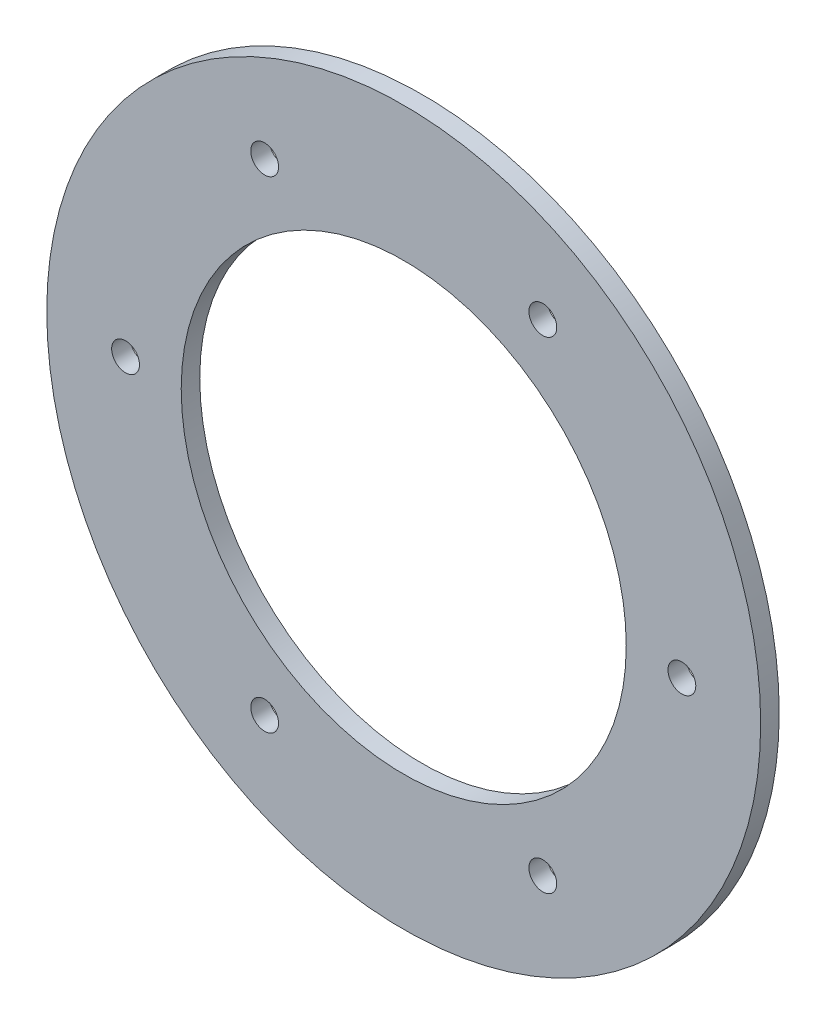
ISO-10303-21;
HEADER;
FILE_DESCRIPTION(('STEP AP214'),'2;1');
FILE_NAME('part.step','',(''),(''),'','','');
FILE_SCHEMA(('AUTOMOTIVE_DESIGN { 1 0 10303 214 1 1 1 1 }'));
ENDSEC;
DATA;
#1=APPLICATION_CONTEXT('core data for automotive mechanical design processes');
#2=APPLICATION_PROTOCOL_DEFINITION('international standard','automotive_design',2000,#1);
#3=PRODUCT_CONTEXT('',#1,'mechanical');
#4=PRODUCT('Part','Part','',(#3));
#5=PRODUCT_RELATED_PRODUCT_CATEGORY('part','',(#4));
#6=PRODUCT_DEFINITION_FORMATION('','',#4);
#7=PRODUCT_DEFINITION_CONTEXT('part definition',#1,'design');
#8=PRODUCT_DEFINITION('design','',#6,#7);
#9=PRODUCT_DEFINITION_SHAPE('','',#8);
#10=(LENGTH_UNIT() NAMED_UNIT(*) SI_UNIT(.MILLI.,.METRE.));
#11=(NAMED_UNIT(*) PLANE_ANGLE_UNIT() SI_UNIT($,.RADIAN.));
#12=(NAMED_UNIT(*) SI_UNIT($,.STERADIAN.) SOLID_ANGLE_UNIT());
#13=UNCERTAINTY_MEASURE_WITH_UNIT(LENGTH_MEASURE(1.E-05),#10,'distance_accuracy_value','');
#14=(GEOMETRIC_REPRESENTATION_CONTEXT(3) GLOBAL_UNCERTAINTY_ASSIGNED_CONTEXT((#13)) GLOBAL_UNIT_ASSIGNED_CONTEXT((#10,
#11,#12)) REPRESENTATION_CONTEXT('',''));
#15=CARTESIAN_POINT('',(0.,0.,0.));
#16=DIRECTION('',(0.,0.,1.));
#17=DIRECTION('',(1.,0.,0.));
#18=AXIS2_PLACEMENT_3D('',#15,#16,#17);
#19=CARTESIAN_POINT('',(0.,0.,2.));
#20=DIRECTION('',(0.,0.,1.));
#21=DIRECTION('',(1.,0.,0.));
#22=AXIS2_PLACEMENT_3D('',#19,#20,#21);
#23=PLANE('',#22);
#24=CARTESIAN_POINT('',(30.0000000000007,-4.44089209850063E-13,2.));
#25=DIRECTION('',(0.,0.,1.));
#26=DIRECTION('',(1.,0.,0.));
#27=AXIS2_PLACEMENT_3D('',#24,#25,#26);
#28=CIRCLE('',#27,1.50000000000006);
#29=CARTESIAN_POINT('',(31.5000000000007,-4.44089209850063E-13,2.));
#30=VERTEX_POINT('',#29);
#31=EDGE_CURVE('E72',#30,#30,#28,.T.);
#32=ORIENTED_EDGE('',*,*,#31,.F.);
#33=EDGE_LOOP('',(#32));
#34=FACE_BOUND('',#33,.T.);
#35=CARTESIAN_POINT('',(-14.9999999999948,25.9807621135328,2.));
#36=DIRECTION('',(0.,0.,1.));
#37=DIRECTION('',(1.,0.,0.));
#38=AXIS2_PLACEMENT_3D('',#35,#36,#37);
#39=CIRCLE('',#38,1.49999999999496);
#40=CARTESIAN_POINT('',(-13.4999999999998,25.9807621135328,2.));
#41=VERTEX_POINT('',#40);
#42=EDGE_CURVE('E60',#41,#41,#39,.T.);
#43=ORIENTED_EDGE('',*,*,#42,.F.);
#44=EDGE_LOOP('',(#43));
#45=FACE_BOUND('',#44,.T.);
#46=CARTESIAN_POINT('',(-14.9999999999948,-25.9807621135364,2.));
#47=DIRECTION('',(0.,0.,1.));
#48=DIRECTION('',(1.,0.,0.));
#49=AXIS2_PLACEMENT_3D('',#46,#47,#48);
#50=CIRCLE('',#49,1.50000000000006);
#51=CARTESIAN_POINT('',(-13.4999999999947,-25.9807621135364,2.));
#52=VERTEX_POINT('',#51);
#53=EDGE_CURVE('E48',#52,#52,#50,.T.);
#54=ORIENTED_EDGE('',*,*,#53,.F.);
#55=EDGE_LOOP('',(#54));
#56=FACE_BOUND('',#55,.T.);
#57=CARTESIAN_POINT('',(0.,0.,2.));
#58=DIRECTION('',(0.,0.,1.));
#59=DIRECTION('',(1.,0.,0.));
#60=AXIS2_PLACEMENT_3D('',#57,#58,#59);
#61=CIRCLE('',#60,38.5);
#62=CARTESIAN_POINT('',(38.5,0.,2.));
#63=VERTEX_POINT('',#62);
#64=EDGE_CURVE('E10',#63,#63,#61,.T.);
#65=ORIENTED_EDGE('',*,*,#64,.T.);
#66=EDGE_LOOP('',(#65));
#67=FACE_BOUND('',#66,.T.);
#68=CARTESIAN_POINT('',(-30.0000000000002,-4.44089209850063E-13,2.));
#69=DIRECTION('',(0.,0.,1.));
#70=DIRECTION('',(1.,0.,0.));
#71=AXIS2_PLACEMENT_3D('',#68,#69,#70);
#72=CIRCLE('',#71,1.50000000000006);
#73=CARTESIAN_POINT('',(-28.5000000000002,-4.44089209850063E-13,2.));
#74=VERTEX_POINT('',#73);
#75=EDGE_CURVE('E43',#74,#74,#72,.T.);
#76=ORIENTED_EDGE('',*,*,#75,.F.);
#77=EDGE_LOOP('',(#76));
#78=FACE_BOUND('',#77,.T.);
#79=CARTESIAN_POINT('',(15.0000000000001,25.9807621135328,2.));
#80=DIRECTION('',(0.,0.,1.));
#81=DIRECTION('',(1.,0.,0.));
#82=AXIS2_PLACEMENT_3D('',#79,#80,#81);
#83=CIRCLE('',#82,1.49999999999659);
#84=CARTESIAN_POINT('',(16.4999999999967,25.9807621135328,2.));
#85=VERTEX_POINT('',#84);
#86=EDGE_CURVE('E54',#85,#85,#83,.T.);
#87=ORIENTED_EDGE('',*,*,#86,.F.);
#88=EDGE_LOOP('',(#87));
#89=FACE_BOUND('',#88,.T.);
#90=CARTESIAN_POINT('',(15.0000000000001,-25.9807621135364,2.));
#91=DIRECTION('',(0.,0.,1.));
#92=DIRECTION('',(1.,0.,0.));
#93=AXIS2_PLACEMENT_3D('',#90,#91,#92);
#94=CIRCLE('',#93,1.50000000000097);
#95=CARTESIAN_POINT('',(16.5000000000011,-25.9807621135364,2.));
#96=VERTEX_POINT('',#95);
#97=EDGE_CURVE('E66',#96,#96,#94,.T.);
#98=ORIENTED_EDGE('',*,*,#97,.F.);
#99=EDGE_LOOP('',(#98));
#100=FACE_BOUND('',#99,.T.);
#101=CARTESIAN_POINT('',(0.,0.,2.));
#102=DIRECTION('',(0.,0.,1.));
#103=DIRECTION('',(1.,0.,0.));
#104=AXIS2_PLACEMENT_3D('',#101,#102,#103);
#105=CIRCLE('',#104,24.);
#106=CARTESIAN_POINT('',(24.,0.,2.));
#107=VERTEX_POINT('',#106);
#108=EDGE_CURVE('E78',#107,#107,#105,.T.);
#109=ORIENTED_EDGE('',*,*,#108,.F.);
#110=EDGE_LOOP('',(#109));
#111=FACE_BOUND('',#110,.T.);
#112=ADVANCED_FACE('F32',(#34,#45,#56,#67,#78,#89,#100,#111),#23,.T.);
#113=CARTESIAN_POINT('',(0.,0.,0.));
#114=DIRECTION('',(0.,0.,1.));
#115=DIRECTION('',(1.,0.,0.));
#116=AXIS2_PLACEMENT_3D('',#113,#114,#115);
#117=PLANE('',#116);
#118=CARTESIAN_POINT('',(30.0000000000007,-4.44089209850063E-13,0.));
#119=DIRECTION('',(0.,0.,1.));
#120=DIRECTION('',(1.,0.,0.));
#121=AXIS2_PLACEMENT_3D('',#118,#119,#120);
#122=CIRCLE('',#121,1.50000000000006);
#123=CARTESIAN_POINT('',(31.5000000000007,-4.44089209850063E-13,0.));
#124=VERTEX_POINT('',#123);
#125=EDGE_CURVE('E75',#124,#124,#122,.T.);
#126=ORIENTED_EDGE('',*,*,#125,.T.);
#127=EDGE_LOOP('',(#126));
#128=FACE_BOUND('',#127,.T.);
#129=CARTESIAN_POINT('',(-14.9999999999948,25.9807621135328,0.));
#130=DIRECTION('',(0.,0.,1.));
#131=DIRECTION('',(1.,0.,0.));
#132=AXIS2_PLACEMENT_3D('',#129,#130,#131);
#133=CIRCLE('',#132,1.49999999999496);
#134=CARTESIAN_POINT('',(-13.4999999999998,25.9807621135328,0.));
#135=VERTEX_POINT('',#134);
#136=EDGE_CURVE('E63',#135,#135,#133,.T.);
#137=ORIENTED_EDGE('',*,*,#136,.T.);
#138=EDGE_LOOP('',(#137));
#139=FACE_BOUND('',#138,.T.);
#140=CARTESIAN_POINT('',(-14.9999999999948,-25.9807621135364,0.));
#141=DIRECTION('',(0.,0.,1.));
#142=DIRECTION('',(1.,0.,0.));
#143=AXIS2_PLACEMENT_3D('',#140,#141,#142);
#144=CIRCLE('',#143,1.50000000000006);
#145=CARTESIAN_POINT('',(-13.4999999999947,-25.9807621135364,0.));
#146=VERTEX_POINT('',#145);
#147=EDGE_CURVE('E51',#146,#146,#144,.T.);
#148=ORIENTED_EDGE('',*,*,#147,.T.);
#149=EDGE_LOOP('',(#148));
#150=FACE_BOUND('',#149,.T.);
#151=CARTESIAN_POINT('',(0.,0.,0.));
#152=DIRECTION('',(0.,0.,1.));
#153=DIRECTION('',(1.,0.,0.));
#154=AXIS2_PLACEMENT_3D('',#151,#152,#153);
#155=CIRCLE('',#154,38.5);
#156=CARTESIAN_POINT('',(38.5,0.,0.));
#157=VERTEX_POINT('',#156);
#158=EDGE_CURVE('E36',#157,#157,#155,.T.);
#159=ORIENTED_EDGE('',*,*,#158,.F.);
#160=EDGE_LOOP('',(#159));
#161=FACE_BOUND('',#160,.T.);
#162=CARTESIAN_POINT('',(-30.0000000000002,-4.44089209850063E-13,0.));
#163=DIRECTION('',(0.,0.,1.));
#164=DIRECTION('',(1.,0.,0.));
#165=AXIS2_PLACEMENT_3D('',#162,#163,#164);
#166=CIRCLE('',#165,1.50000000000006);
#167=CARTESIAN_POINT('',(-28.5000000000002,-4.44089209850063E-13,0.));
#168=VERTEX_POINT('',#167);
#169=EDGE_CURVE('E45',#168,#168,#166,.T.);
#170=ORIENTED_EDGE('',*,*,#169,.T.);
#171=EDGE_LOOP('',(#170));
#172=FACE_BOUND('',#171,.T.);
#173=CARTESIAN_POINT('',(15.0000000000001,25.9807621135328,0.));
#174=DIRECTION('',(0.,0.,1.));
#175=DIRECTION('',(1.,0.,0.));
#176=AXIS2_PLACEMENT_3D('',#173,#174,#175);
#177=CIRCLE('',#176,1.49999999999659);
#178=CARTESIAN_POINT('',(16.4999999999967,25.9807621135328,0.));
#179=VERTEX_POINT('',#178);
#180=EDGE_CURVE('E57',#179,#179,#177,.T.);
#181=ORIENTED_EDGE('',*,*,#180,.T.);
#182=EDGE_LOOP('',(#181));
#183=FACE_BOUND('',#182,.T.);
#184=CARTESIAN_POINT('',(15.0000000000001,-25.9807621135364,0.));
#185=DIRECTION('',(0.,0.,1.));
#186=DIRECTION('',(1.,0.,0.));
#187=AXIS2_PLACEMENT_3D('',#184,#185,#186);
#188=CIRCLE('',#187,1.50000000000097);
#189=CARTESIAN_POINT('',(16.5000000000011,-25.9807621135364,0.));
#190=VERTEX_POINT('',#189);
#191=EDGE_CURVE('E69',#190,#190,#188,.T.);
#192=ORIENTED_EDGE('',*,*,#191,.T.);
#193=EDGE_LOOP('',(#192));
#194=FACE_BOUND('',#193,.T.);
#195=CARTESIAN_POINT('',(0.,0.,0.));
#196=DIRECTION('',(0.,0.,1.));
#197=DIRECTION('',(1.,0.,0.));
#198=AXIS2_PLACEMENT_3D('',#195,#196,#197);
#199=CIRCLE('',#198,24.);
#200=CARTESIAN_POINT('',(24.,0.,0.));
#201=VERTEX_POINT('',#200);
#202=EDGE_CURVE('E81',#201,#201,#199,.T.);
#203=ORIENTED_EDGE('',*,*,#202,.T.);
#204=EDGE_LOOP('',(#203));
#205=FACE_BOUND('',#204,.T.);
#206=ADVANCED_FACE('F91',(#128,#139,#150,#161,#172,#183,#194,#205),#117,.F.);
#207=CARTESIAN_POINT('',(0.,0.,2.));
#208=DIRECTION('',(0.,0.,-1.));
#209=DIRECTION('',(-1.,0.,0.));
#210=AXIS2_PLACEMENT_3D('',#207,#208,#209);
#211=CYLINDRICAL_SURFACE('',#210,38.5);
#212=ORIENTED_EDGE('',*,*,#64,.F.);
#213=EDGE_LOOP('',(#212));
#214=FACE_BOUND('',#213,.T.);
#215=ORIENTED_EDGE('',*,*,#158,.T.);
#216=EDGE_LOOP('',(#215));
#217=FACE_BOUND('',#216,.T.);
#218=ADVANCED_FACE('F34',(#214,#217),#211,.T.);
#219=CARTESIAN_POINT('',(-30.0000000000002,-4.44089209850063E-13,2.));
#220=DIRECTION('',(0.,0.,-1.));
#221=DIRECTION('',(-1.,0.,0.));
#222=AXIS2_PLACEMENT_3D('',#219,#220,#221);
#223=CYLINDRICAL_SURFACE('',#222,1.50000000000006);
#224=ORIENTED_EDGE('',*,*,#75,.T.);
#225=EDGE_LOOP('',(#224));
#226=FACE_BOUND('',#225,.T.);
#227=ORIENTED_EDGE('',*,*,#169,.F.);
#228=EDGE_LOOP('',(#227));
#229=FACE_BOUND('',#228,.T.);
#230=ADVANCED_FACE('F101',(#226,#229),#223,.F.);
#231=CARTESIAN_POINT('',(-14.9999999999948,-25.9807621135364,2.));
#232=DIRECTION('',(0.,0.,-1.));
#233=DIRECTION('',(-1.,0.,0.));
#234=AXIS2_PLACEMENT_3D('',#231,#232,#233);
#235=CYLINDRICAL_SURFACE('',#234,1.50000000000006);
#236=ORIENTED_EDGE('',*,*,#53,.T.);
#237=EDGE_LOOP('',(#236));
#238=FACE_BOUND('',#237,.T.);
#239=ORIENTED_EDGE('',*,*,#147,.F.);
#240=EDGE_LOOP('',(#239));
#241=FACE_BOUND('',#240,.T.);
#242=ADVANCED_FACE('F104',(#238,#241),#235,.F.);
#243=CARTESIAN_POINT('',(15.0000000000001,25.9807621135328,2.));
#244=DIRECTION('',(0.,0.,-1.));
#245=DIRECTION('',(-1.,0.,0.));
#246=AXIS2_PLACEMENT_3D('',#243,#244,#245);
#247=CYLINDRICAL_SURFACE('',#246,1.49999999999659);
#248=ORIENTED_EDGE('',*,*,#86,.T.);
#249=EDGE_LOOP('',(#248));
#250=FACE_BOUND('',#249,.T.);
#251=ORIENTED_EDGE('',*,*,#180,.F.);
#252=EDGE_LOOP('',(#251));
#253=FACE_BOUND('',#252,.T.);
#254=ADVANCED_FACE('F108',(#250,#253),#247,.F.);
#255=CARTESIAN_POINT('',(-14.9999999999948,25.9807621135328,2.));
#256=DIRECTION('',(0.,0.,-1.));
#257=DIRECTION('',(-1.,0.,0.));
#258=AXIS2_PLACEMENT_3D('',#255,#256,#257);
#259=CYLINDRICAL_SURFACE('',#258,1.49999999999496);
#260=ORIENTED_EDGE('',*,*,#42,.T.);
#261=EDGE_LOOP('',(#260));
#262=FACE_BOUND('',#261,.T.);
#263=ORIENTED_EDGE('',*,*,#136,.F.);
#264=EDGE_LOOP('',(#263));
#265=FACE_BOUND('',#264,.T.);
#266=ADVANCED_FACE('F112',(#262,#265),#259,.F.);
#267=CARTESIAN_POINT('',(15.0000000000001,-25.9807621135364,2.));
#268=DIRECTION('',(0.,0.,-1.));
#269=DIRECTION('',(-1.,0.,0.));
#270=AXIS2_PLACEMENT_3D('',#267,#268,#269);
#271=CYLINDRICAL_SURFACE('',#270,1.50000000000097);
#272=ORIENTED_EDGE('',*,*,#97,.T.);
#273=EDGE_LOOP('',(#272));
#274=FACE_BOUND('',#273,.T.);
#275=ORIENTED_EDGE('',*,*,#191,.F.);
#276=EDGE_LOOP('',(#275));
#277=FACE_BOUND('',#276,.T.);
#278=ADVANCED_FACE('F116',(#274,#277),#271,.F.);
#279=CARTESIAN_POINT('',(30.0000000000007,-4.44089209850063E-13,2.));
#280=DIRECTION('',(0.,0.,-1.));
#281=DIRECTION('',(-1.,0.,0.));
#282=AXIS2_PLACEMENT_3D('',#279,#280,#281);
#283=CYLINDRICAL_SURFACE('',#282,1.50000000000006);
#284=ORIENTED_EDGE('',*,*,#31,.T.);
#285=EDGE_LOOP('',(#284));
#286=FACE_BOUND('',#285,.T.);
#287=ORIENTED_EDGE('',*,*,#125,.F.);
#288=EDGE_LOOP('',(#287));
#289=FACE_BOUND('',#288,.T.);
#290=ADVANCED_FACE('F120',(#286,#289),#283,.F.);
#291=CARTESIAN_POINT('',(0.,0.,2.));
#292=DIRECTION('',(0.,0.,-1.));
#293=DIRECTION('',(-1.,0.,0.));
#294=AXIS2_PLACEMENT_3D('',#291,#292,#293);
#295=CYLINDRICAL_SURFACE('',#294,24.);
#296=ORIENTED_EDGE('',*,*,#108,.T.);
#297=EDGE_LOOP('',(#296));
#298=FACE_BOUND('',#297,.T.);
#299=ORIENTED_EDGE('',*,*,#202,.F.);
#300=EDGE_LOOP('',(#299));
#301=FACE_BOUND('',#300,.T.);
#302=ADVANCED_FACE('F87',(#298,#301),#295,.F.);
#303=CLOSED_SHELL('',(#112,#206,#218,#230,#242,#254,#266,#278,#290,#302));
#304=MANIFOLD_SOLID_BREP('B2',#303);
#305=ADVANCED_BREP_SHAPE_REPRESENTATION('',(#18,#304),#14);
#306=SHAPE_DEFINITION_REPRESENTATION(#9,#305);
ENDSEC;
END-ISO-10303-21;
